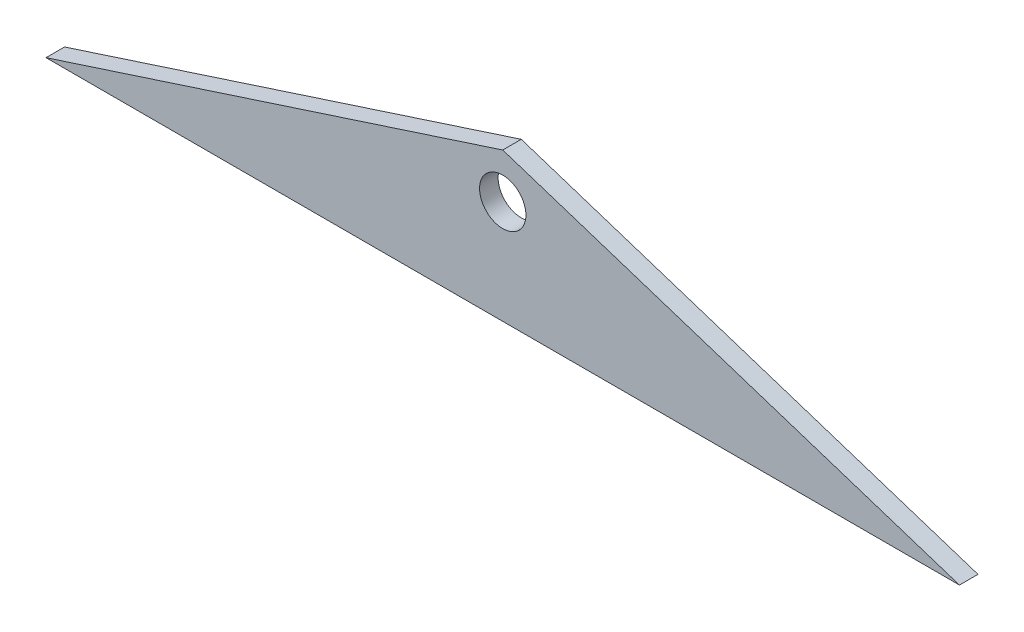
ISO-10303-21;
HEADER;
FILE_DESCRIPTION(('STEP AP214'),'2;1');
FILE_NAME('part.step','',(''),(''),'','','');
FILE_SCHEMA(('AUTOMOTIVE_DESIGN { 1 0 10303 214 1 1 1 1 }'));
ENDSEC;
DATA;
#1=APPLICATION_CONTEXT('core data for automotive mechanical design processes');
#2=APPLICATION_PROTOCOL_DEFINITION('international standard','automotive_design',2000,#1);
#3=PRODUCT_CONTEXT('',#1,'mechanical');
#4=PRODUCT('Part','Part','',(#3));
#5=PRODUCT_RELATED_PRODUCT_CATEGORY('part','',(#4));
#6=PRODUCT_DEFINITION_FORMATION('','',#4);
#7=PRODUCT_DEFINITION_CONTEXT('part definition',#1,'design');
#8=PRODUCT_DEFINITION('design','',#6,#7);
#9=PRODUCT_DEFINITION_SHAPE('','',#8);
#10=(LENGTH_UNIT() NAMED_UNIT(*) SI_UNIT(.MILLI.,.METRE.));
#11=(NAMED_UNIT(*) PLANE_ANGLE_UNIT() SI_UNIT($,.RADIAN.));
#12=(NAMED_UNIT(*) SI_UNIT($,.STERADIAN.) SOLID_ANGLE_UNIT());
#13=UNCERTAINTY_MEASURE_WITH_UNIT(LENGTH_MEASURE(1.E-05),#10,'distance_accuracy_value','');
#14=(GEOMETRIC_REPRESENTATION_CONTEXT(3) GLOBAL_UNCERTAINTY_ASSIGNED_CONTEXT((#13)) GLOBAL_UNIT_ASSIGNED_CONTEXT((#10,
#11,#12)) REPRESENTATION_CONTEXT('',''));
#15=CARTESIAN_POINT('',(0.,0.,0.));
#16=DIRECTION('',(0.,0.,1.));
#17=DIRECTION('',(1.,0.,0.));
#18=AXIS2_PLACEMENT_3D('',#15,#16,#17);
#19=CARTESIAN_POINT('',(-78.1731618442468,-379.672312739514,3.175));
#20=DIRECTION('',(0.,1.,0.));
#21=DIRECTION('',(-1.,0.,0.));
#22=AXIS2_PLACEMENT_3D('',#19,#20,#21);
#23=PLANE('',#22);
#24=DIRECTION('',(1.,0.,0.));
#25=VECTOR('',#24,1.);
#26=CARTESIAN_POINT('',(-78.1731618442468,-379.672312739514,0.));
#27=LINE('',#26,#25);
#28=CARTESIAN_POINT('',(-78.1731618442468,-379.672312739514,0.));
#29=VERTEX_POINT('',#28);
#30=CARTESIAN_POINT('',(78.1731618442549,-379.672312739512,0.));
#31=VERTEX_POINT('',#30);
#32=EDGE_CURVE('E67',#29,#31,#27,.T.);
#33=ORIENTED_EDGE('',*,*,#32,.T.);
#34=DIRECTION('',(0.,0.,-1.));
#35=VECTOR('',#34,1.);
#36=CARTESIAN_POINT('',(78.1731618442549,-379.672312739512,3.175));
#37=LINE('',#36,#35);
#38=CARTESIAN_POINT('',(78.1731618442549,-379.672312739512,3.175));
#39=VERTEX_POINT('',#38);
#40=EDGE_CURVE('E11',#39,#31,#37,.T.);
#41=ORIENTED_EDGE('',*,*,#40,.F.);
#42=DIRECTION('',(1.,0.,0.));
#43=VECTOR('',#42,1.);
#44=CARTESIAN_POINT('',(-78.1731618442468,-379.672312739514,3.175));
#45=LINE('',#44,#43);
#46=CARTESIAN_POINT('',(-78.1731618442468,-379.672312739514,3.175));
#47=VERTEX_POINT('',#46);
#48=EDGE_CURVE('E86',#47,#39,#45,.T.);
#49=ORIENTED_EDGE('',*,*,#48,.F.);
#50=DIRECTION('',(0.,0.,-1.));
#51=VECTOR('',#50,1.);
#52=CARTESIAN_POINT('',(-78.1731618442468,-379.672312739514,3.175));
#53=LINE('',#52,#51);
#54=EDGE_CURVE('E77',#47,#29,#53,.T.);
#55=ORIENTED_EDGE('',*,*,#54,.T.);
#56=EDGE_LOOP('',(#33,#41,#49,#55));
#57=FACE_BOUND('',#56,.T.);
#58=ADVANCED_FACE('F31',(#57),#23,.F.);
#59=CARTESIAN_POINT('',(78.1731618442549,-379.672312739512,3.175));
#60=DIRECTION('',(-0.30901699437494,-0.951056516295156,0.));
#61=DIRECTION('',(0.951056516295156,-0.30901699437494,0.));
#62=AXIS2_PLACEMENT_3D('',#59,#60,#61);
#63=PLANE('',#62);
#64=DIRECTION('',(-0.951056516295156,0.30901699437494,0.));
#65=VECTOR('',#64,1.);
#66=CARTESIAN_POINT('',(78.1731618442549,-379.672312739512,0.));
#67=LINE('',#66,#65);
#68=CARTESIAN_POINT('',(3.78951735845879E-12,-354.272312739513,0.));
#69=VERTEX_POINT('',#68);
#70=EDGE_CURVE('E64',#31,#69,#67,.T.);
#71=ORIENTED_EDGE('',*,*,#70,.T.);
#72=DIRECTION('',(0.,0.,-1.));
#73=VECTOR('',#72,1.);
#74=CARTESIAN_POINT('',(3.78951735845879E-12,-354.272312739513,3.175));
#75=LINE('',#74,#73);
#76=CARTESIAN_POINT('',(3.78951735845879E-12,-354.272312739513,3.175));
#77=VERTEX_POINT('',#76);
#78=EDGE_CURVE('E38',#77,#69,#75,.T.);
#79=ORIENTED_EDGE('',*,*,#78,.F.);
#80=DIRECTION('',(-0.951056516295156,0.30901699437494,0.));
#81=VECTOR('',#80,1.);
#82=CARTESIAN_POINT('',(78.1731618442549,-379.672312739512,3.175));
#83=LINE('',#82,#81);
#84=EDGE_CURVE('E49',#39,#77,#83,.T.);
#85=ORIENTED_EDGE('',*,*,#84,.F.);
#86=ORIENTED_EDGE('',*,*,#40,.T.);
#87=EDGE_LOOP('',(#71,#79,#85,#86));
#88=FACE_BOUND('',#87,.T.);
#89=ADVANCED_FACE('F73',(#88),#63,.F.);
#90=CARTESIAN_POINT('',(3.78951735845879E-12,-354.272312739513,3.175));
#91=DIRECTION('',(0.309016994374959,-0.95105651629515,0.));
#92=DIRECTION('',(0.95105651629515,0.309016994374959,0.));
#93=AXIS2_PLACEMENT_3D('',#90,#91,#92);
#94=PLANE('',#93);
#95=DIRECTION('',(-0.95105651629515,-0.309016994374959,0.));
#96=VECTOR('',#95,1.);
#97=CARTESIAN_POINT('',(3.78951735845879E-12,-354.272312739513,0.));
#98=LINE('',#97,#96);
#99=EDGE_CURVE('E68',#69,#29,#98,.T.);
#100=ORIENTED_EDGE('',*,*,#99,.T.);
#101=ORIENTED_EDGE('',*,*,#54,.F.);
#102=DIRECTION('',(-0.95105651629515,-0.309016994374959,0.));
#103=VECTOR('',#102,1.);
#104=CARTESIAN_POINT('',(3.78951735845879E-12,-354.272312739513,3.175));
#105=LINE('',#104,#103);
#106=EDGE_CURVE('E45',#77,#47,#105,.T.);
#107=ORIENTED_EDGE('',*,*,#106,.F.);
#108=ORIENTED_EDGE('',*,*,#78,.T.);
#109=EDGE_LOOP('',(#100,#101,#107,#108));
#110=FACE_BOUND('',#109,.T.);
#111=ADVANCED_FACE('F91',(#110),#94,.F.);
#112=CARTESIAN_POINT('',(78.1731618442552,-379.672312739512,3.175));
#113=DIRECTION('',(0.,0.,1.));
#114=DIRECTION('',(1.,0.,0.));
#115=AXIS2_PLACEMENT_3D('',#112,#113,#114);
#116=PLANE('',#115);
#117=CARTESIAN_POINT('',(0.,-361.95,3.175));
#118=DIRECTION('',(0.,0.,1.));
#119=DIRECTION('',(1.,0.,0.));
#120=AXIS2_PLACEMENT_3D('',#117,#118,#119);
#121=CIRCLE('',#120,3.96875000000001);
#122=CARTESIAN_POINT('',(3.96875000000005,-361.95,3.175));
#123=VERTEX_POINT('',#122);
#124=EDGE_CURVE('E81',#123,#123,#121,.T.);
#125=ORIENTED_EDGE('',*,*,#124,.F.);
#126=EDGE_LOOP('',(#125));
#127=FACE_BOUND('',#126,.T.);
#128=ORIENTED_EDGE('',*,*,#48,.T.);
#129=ORIENTED_EDGE('',*,*,#84,.T.);
#130=ORIENTED_EDGE('',*,*,#106,.T.);
#131=EDGE_LOOP('',(#128,#129,#130));
#132=FACE_BOUND('',#131,.T.);
#133=ADVANCED_FACE('F92',(#127,#132),#116,.T.);
#134=CARTESIAN_POINT('',(78.1731618442552,-379.672312739512,0.));
#135=DIRECTION('',(0.,0.,1.));
#136=DIRECTION('',(1.,0.,0.));
#137=AXIS2_PLACEMENT_3D('',#134,#135,#136);
#138=PLANE('',#137);
#139=CARTESIAN_POINT('',(0.,-361.95,0.));
#140=DIRECTION('',(0.,0.,1.));
#141=DIRECTION('',(1.,0.,0.));
#142=AXIS2_PLACEMENT_3D('',#139,#140,#141);
#143=CIRCLE('',#142,3.96875000000001);
#144=CARTESIAN_POINT('',(3.96875000000005,-361.95,0.));
#145=VERTEX_POINT('',#144);
#146=EDGE_CURVE('E78',#145,#145,#143,.F.);
#147=ORIENTED_EDGE('',*,*,#146,.F.);
#148=EDGE_LOOP('',(#147));
#149=FACE_BOUND('',#148,.T.);
#150=ORIENTED_EDGE('',*,*,#32,.F.);
#151=ORIENTED_EDGE('',*,*,#99,.F.);
#152=ORIENTED_EDGE('',*,*,#70,.F.);
#153=EDGE_LOOP('',(#150,#151,#152));
#154=FACE_BOUND('',#153,.T.);
#155=ADVANCED_FACE('F65',(#149,#154),#138,.F.);
#156=CARTESIAN_POINT('',(0.,-361.95,-0.00100000000000013));
#157=DIRECTION('',(0.,0.,1.));
#158=DIRECTION('',(1.,0.,0.));
#159=AXIS2_PLACEMENT_3D('',#156,#157,#158);
#160=CYLINDRICAL_SURFACE('',#159,3.96875000000001);
#161=ORIENTED_EDGE('',*,*,#124,.T.);
#162=EDGE_LOOP('',(#161));
#163=FACE_BOUND('',#162,.T.);
#164=ORIENTED_EDGE('',*,*,#146,.T.);
#165=EDGE_LOOP('',(#164));
#166=FACE_BOUND('',#165,.T.);
#167=ADVANCED_FACE('F100',(#163,#166),#160,.F.);
#168=CLOSED_SHELL('',(#58,#89,#111,#133,#155,#167));
#169=MANIFOLD_SOLID_BREP('B2',#168);
#170=ADVANCED_BREP_SHAPE_REPRESENTATION('',(#18,#169),#14);
#171=SHAPE_DEFINITION_REPRESENTATION(#9,#170);
ENDSEC;
END-ISO-10303-21;
